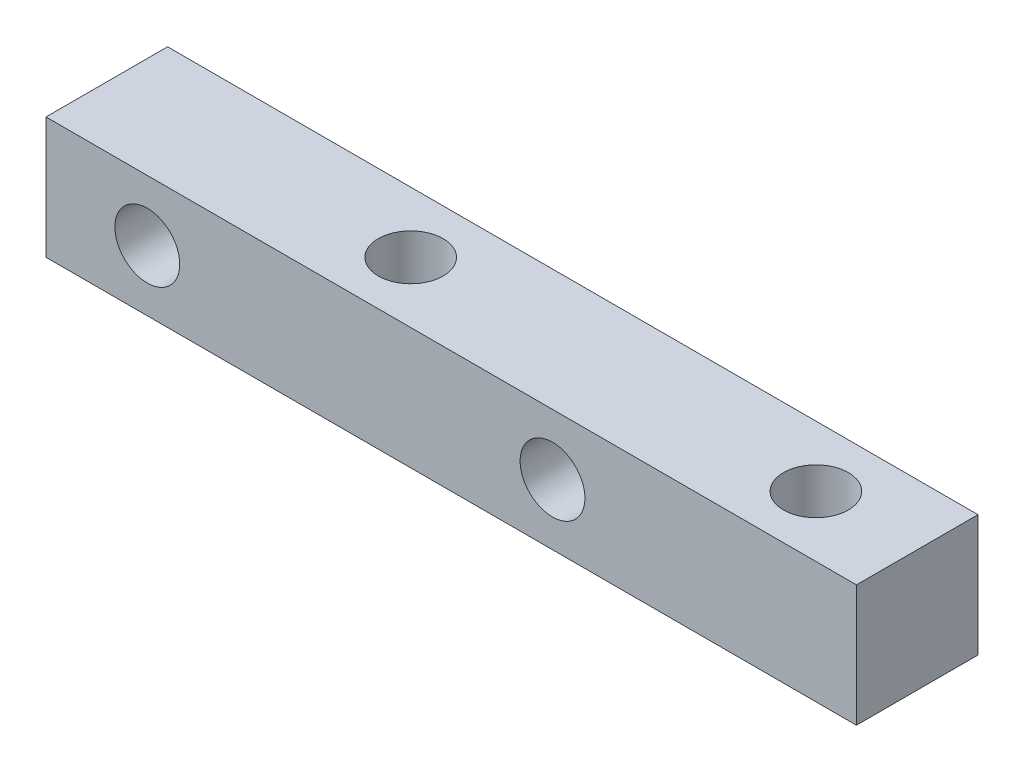
ISO-10303-21;
HEADER;
FILE_DESCRIPTION(('STEP AP214'),'2;1');
FILE_NAME('part.step','',(''),(''),'','','');
FILE_SCHEMA(('AUTOMOTIVE_DESIGN { 1 0 10303 214 1 1 1 1 }'));
ENDSEC;
DATA;
#1=APPLICATION_CONTEXT('core data for automotive mechanical design processes');
#2=APPLICATION_PROTOCOL_DEFINITION('international standard','automotive_design',2000,#1);
#3=PRODUCT_CONTEXT('',#1,'mechanical');
#4=PRODUCT('Part','Part','',(#3));
#5=PRODUCT_RELATED_PRODUCT_CATEGORY('part','',(#4));
#6=PRODUCT_DEFINITION_FORMATION('','',#4);
#7=PRODUCT_DEFINITION_CONTEXT('part definition',#1,'design');
#8=PRODUCT_DEFINITION('design','',#6,#7);
#9=PRODUCT_DEFINITION_SHAPE('','',#8);
#10=(LENGTH_UNIT() NAMED_UNIT(*) SI_UNIT(.MILLI.,.METRE.));
#11=(NAMED_UNIT(*) PLANE_ANGLE_UNIT() SI_UNIT($,.RADIAN.));
#12=(NAMED_UNIT(*) SI_UNIT($,.STERADIAN.) SOLID_ANGLE_UNIT());
#13=UNCERTAINTY_MEASURE_WITH_UNIT(LENGTH_MEASURE(1.E-05),#10,'distance_accuracy_value','');
#14=(GEOMETRIC_REPRESENTATION_CONTEXT(3) GLOBAL_UNCERTAINTY_ASSIGNED_CONTEXT((#13)) GLOBAL_UNIT_ASSIGNED_CONTEXT((#10,
#11,#12)) REPRESENTATION_CONTEXT('',''));
#15=CARTESIAN_POINT('',(0.,0.,0.));
#16=DIRECTION('',(0.,0.,1.));
#17=DIRECTION('',(1.,0.,0.));
#18=AXIS2_PLACEMENT_3D('',#15,#16,#17);
#19=CARTESIAN_POINT('',(0.,0.,6.));
#20=DIRECTION('',(0.,0.,-1.));
#21=DIRECTION('',(-1.,0.,0.));
#22=AXIS2_PLACEMENT_3D('',#19,#20,#21);
#23=PLANE('',#22);
#24=DIRECTION('',(1.,0.,0.));
#25=VECTOR('',#24,1.);
#26=CARTESIAN_POINT('',(40.,0.,6.));
#27=LINE('',#26,#25);
#28=CARTESIAN_POINT('',(0.,0.,6.));
#29=VERTEX_POINT('',#28);
#30=CARTESIAN_POINT('',(40.,0.,6.));
#31=VERTEX_POINT('',#30);
#32=EDGE_CURVE('E92',#29,#31,#27,.T.);
#33=ORIENTED_EDGE('',*,*,#32,.T.);
#34=DIRECTION('',(0.,1.,0.));
#35=VECTOR('',#34,1.);
#36=CARTESIAN_POINT('',(40.,6.,6.));
#37=LINE('',#36,#35);
#38=CARTESIAN_POINT('',(40.,6.,6.));
#39=VERTEX_POINT('',#38);
#40=EDGE_CURVE('E87',#31,#39,#37,.T.);
#41=ORIENTED_EDGE('',*,*,#40,.T.);
#42=DIRECTION('',(-1.,0.,0.));
#43=VECTOR('',#42,1.);
#44=CARTESIAN_POINT('',(0.,6.,6.));
#45=LINE('',#44,#43);
#46=CARTESIAN_POINT('',(0.,6.,6.));
#47=VERTEX_POINT('',#46);
#48=EDGE_CURVE('E90',#39,#47,#45,.T.);
#49=ORIENTED_EDGE('',*,*,#48,.T.);
#50=DIRECTION('',(0.,-1.,0.));
#51=VECTOR('',#50,1.);
#52=CARTESIAN_POINT('',(0.,0.,6.));
#53=LINE('',#52,#51);
#54=EDGE_CURVE('E57',#47,#29,#53,.T.);
#55=ORIENTED_EDGE('',*,*,#54,.T.);
#56=EDGE_LOOP('',(#33,#41,#49,#55));
#57=FACE_BOUND('',#56,.T.);
#58=CARTESIAN_POINT('',(5.,3.,6.));
#59=DIRECTION('',(0.,0.,1.));
#60=DIRECTION('',(1.,0.,0.));
#61=AXIS2_PLACEMENT_3D('',#58,#59,#60);
#62=CIRCLE('',#61,1.6);
#63=CARTESIAN_POINT('',(6.6,3.,6.));
#64=VERTEX_POINT('',#63);
#65=EDGE_CURVE('E112',#64,#64,#62,.T.);
#66=ORIENTED_EDGE('',*,*,#65,.F.);
#67=EDGE_LOOP('',(#66));
#68=FACE_BOUND('',#67,.T.);
#69=CARTESIAN_POINT('',(25.,3.,6.));
#70=DIRECTION('',(0.,0.,1.));
#71=DIRECTION('',(1.,0.,0.));
#72=AXIS2_PLACEMENT_3D('',#69,#70,#71);
#73=CIRCLE('',#72,1.6);
#74=CARTESIAN_POINT('',(26.6,3.,6.));
#75=VERTEX_POINT('',#74);
#76=EDGE_CURVE('E134',#75,#75,#73,.T.);
#77=ORIENTED_EDGE('',*,*,#76,.F.);
#78=EDGE_LOOP('',(#77));
#79=FACE_BOUND('',#78,.T.);
#80=ADVANCED_FACE('F39',(#57,#68,#79),#23,.F.);
#81=CARTESIAN_POINT('',(0.,0.,0.));
#82=DIRECTION('',(0.,0.,-1.));
#83=DIRECTION('',(-1.,0.,0.));
#84=AXIS2_PLACEMENT_3D('',#81,#82,#83);
#85=PLANE('',#84);
#86=CARTESIAN_POINT('',(5.,3.,0.));
#87=DIRECTION('',(0.,0.,1.));
#88=DIRECTION('',(1.,0.,0.));
#89=AXIS2_PLACEMENT_3D('',#86,#87,#88);
#90=CIRCLE('',#89,1.6);
#91=CARTESIAN_POINT('',(6.6,3.,0.));
#92=VERTEX_POINT('',#91);
#93=EDGE_CURVE('E130',#92,#92,#90,.T.);
#94=ORIENTED_EDGE('',*,*,#93,.T.);
#95=EDGE_LOOP('',(#94));
#96=FACE_BOUND('',#95,.T.);
#97=DIRECTION('',(1.,0.,0.));
#98=VECTOR('',#97,1.);
#99=CARTESIAN_POINT('',(40.,0.,0.));
#100=LINE('',#99,#98);
#101=CARTESIAN_POINT('',(0.,0.,0.));
#102=VERTEX_POINT('',#101);
#103=CARTESIAN_POINT('',(40.,0.,0.));
#104=VERTEX_POINT('',#103);
#105=EDGE_CURVE('E108',#102,#104,#100,.T.);
#106=ORIENTED_EDGE('',*,*,#105,.F.);
#107=DIRECTION('',(0.,-1.,0.));
#108=VECTOR('',#107,1.);
#109=CARTESIAN_POINT('',(0.,0.,0.));
#110=LINE('',#109,#108);
#111=CARTESIAN_POINT('',(0.,6.,0.));
#112=VERTEX_POINT('',#111);
#113=EDGE_CURVE('E80',#112,#102,#110,.T.);
#114=ORIENTED_EDGE('',*,*,#113,.F.);
#115=DIRECTION('',(-1.,0.,0.));
#116=VECTOR('',#115,1.);
#117=CARTESIAN_POINT('',(0.,6.,0.));
#118=LINE('',#117,#116);
#119=CARTESIAN_POINT('',(40.,6.,0.));
#120=VERTEX_POINT('',#119);
#121=EDGE_CURVE('E74',#120,#112,#118,.T.);
#122=ORIENTED_EDGE('',*,*,#121,.F.);
#123=DIRECTION('',(0.,1.,0.));
#124=VECTOR('',#123,1.);
#125=CARTESIAN_POINT('',(40.,6.,0.));
#126=LINE('',#125,#124);
#127=EDGE_CURVE('E97',#104,#120,#126,.T.);
#128=ORIENTED_EDGE('',*,*,#127,.F.);
#129=EDGE_LOOP('',(#106,#114,#122,#128));
#130=FACE_BOUND('',#129,.T.);
#131=CARTESIAN_POINT('',(25.,3.,0.));
#132=DIRECTION('',(0.,0.,1.));
#133=DIRECTION('',(1.,0.,0.));
#134=AXIS2_PLACEMENT_3D('',#131,#132,#133);
#135=CIRCLE('',#134,1.6);
#136=CARTESIAN_POINT('',(26.6,3.,0.));
#137=VERTEX_POINT('',#136);
#138=EDGE_CURVE('E138',#137,#137,#135,.T.);
#139=ORIENTED_EDGE('',*,*,#138,.T.);
#140=EDGE_LOOP('',(#139));
#141=FACE_BOUND('',#140,.T.);
#142=ADVANCED_FACE('F125',(#96,#130,#141),#85,.T.);
#143=CARTESIAN_POINT('',(40.,0.,6.));
#144=DIRECTION('',(0.,1.,0.));
#145=DIRECTION('',(0.,0.,1.));
#146=AXIS2_PLACEMENT_3D('',#143,#144,#145);
#147=PLANE('',#146);
#148=CARTESIAN_POINT('',(15.,0.,3.));
#149=DIRECTION('',(0.,1.,0.));
#150=DIRECTION('',(0.,0.,1.));
#151=AXIS2_PLACEMENT_3D('',#148,#149,#150);
#152=CIRCLE('',#151,1.6);
#153=CARTESIAN_POINT('',(15.,0.,4.6));
#154=VERTEX_POINT('',#153);
#155=EDGE_CURVE('E142',#154,#154,#152,.T.);
#156=ORIENTED_EDGE('',*,*,#155,.T.);
#157=EDGE_LOOP('',(#156));
#158=FACE_BOUND('',#157,.T.);
#159=CARTESIAN_POINT('',(35.,0.,3.));
#160=DIRECTION('',(0.,1.,0.));
#161=DIRECTION('',(0.,0.,1.));
#162=AXIS2_PLACEMENT_3D('',#159,#160,#161);
#163=CIRCLE('',#162,1.6);
#164=CARTESIAN_POINT('',(35.,0.,4.6));
#165=VERTEX_POINT('',#164);
#166=EDGE_CURVE('E150',#165,#165,#163,.T.);
#167=ORIENTED_EDGE('',*,*,#166,.T.);
#168=EDGE_LOOP('',(#167));
#169=FACE_BOUND('',#168,.T.);
#170=ORIENTED_EDGE('',*,*,#105,.T.);
#171=DIRECTION('',(0.,0.,-1.));
#172=VECTOR('',#171,1.);
#173=CARTESIAN_POINT('',(40.,0.,6.));
#174=LINE('',#173,#172);
#175=EDGE_CURVE('E11',#31,#104,#174,.T.);
#176=ORIENTED_EDGE('',*,*,#175,.F.);
#177=ORIENTED_EDGE('',*,*,#32,.F.);
#178=DIRECTION('',(0.,0.,-1.));
#179=VECTOR('',#178,1.);
#180=CARTESIAN_POINT('',(0.,0.,6.));
#181=LINE('',#180,#179);
#182=EDGE_CURVE('E104',#29,#102,#181,.T.);
#183=ORIENTED_EDGE('',*,*,#182,.T.);
#184=EDGE_LOOP('',(#170,#176,#177,#183));
#185=FACE_BOUND('',#184,.T.);
#186=ADVANCED_FACE('F41',(#158,#169,#185),#147,.F.);
#187=CARTESIAN_POINT('',(40.,6.,6.));
#188=DIRECTION('',(-1.,0.,0.));
#189=DIRECTION('',(0.,0.,1.));
#190=AXIS2_PLACEMENT_3D('',#187,#188,#189);
#191=PLANE('',#190);
#192=ORIENTED_EDGE('',*,*,#127,.T.);
#193=DIRECTION('',(0.,0.,-1.));
#194=VECTOR('',#193,1.);
#195=CARTESIAN_POINT('',(40.,6.,6.));
#196=LINE('',#195,#194);
#197=EDGE_CURVE('E49',#39,#120,#196,.T.);
#198=ORIENTED_EDGE('',*,*,#197,.F.);
#199=ORIENTED_EDGE('',*,*,#40,.F.);
#200=ORIENTED_EDGE('',*,*,#175,.T.);
#201=EDGE_LOOP('',(#192,#198,#199,#200));
#202=FACE_BOUND('',#201,.T.);
#203=ADVANCED_FACE('F96',(#202),#191,.F.);
#204=CARTESIAN_POINT('',(0.,6.,6.));
#205=DIRECTION('',(0.,-1.,0.));
#206=DIRECTION('',(0.,0.,-1.));
#207=AXIS2_PLACEMENT_3D('',#204,#205,#206);
#208=PLANE('',#207);
#209=CARTESIAN_POINT('',(15.,6.,3.));
#210=DIRECTION('',(0.,1.,0.));
#211=DIRECTION('',(0.,0.,1.));
#212=AXIS2_PLACEMENT_3D('',#209,#210,#211);
#213=CIRCLE('',#212,1.6);
#214=CARTESIAN_POINT('',(15.,6.,4.6));
#215=VERTEX_POINT('',#214);
#216=EDGE_CURVE('E154',#215,#215,#213,.T.);
#217=ORIENTED_EDGE('',*,*,#216,.F.);
#218=EDGE_LOOP('',(#217));
#219=FACE_BOUND('',#218,.T.);
#220=CARTESIAN_POINT('',(35.,6.,3.));
#221=DIRECTION('',(0.,1.,0.));
#222=DIRECTION('',(0.,0.,1.));
#223=AXIS2_PLACEMENT_3D('',#220,#221,#222);
#224=CIRCLE('',#223,1.6);
#225=CARTESIAN_POINT('',(35.,6.,4.6));
#226=VERTEX_POINT('',#225);
#227=EDGE_CURVE('E146',#226,#226,#224,.T.);
#228=ORIENTED_EDGE('',*,*,#227,.F.);
#229=EDGE_LOOP('',(#228));
#230=FACE_BOUND('',#229,.T.);
#231=ORIENTED_EDGE('',*,*,#121,.T.);
#232=DIRECTION('',(0.,0.,-1.));
#233=VECTOR('',#232,1.);
#234=CARTESIAN_POINT('',(0.,6.,6.));
#235=LINE('',#234,#233);
#236=EDGE_CURVE('E99',#47,#112,#235,.T.);
#237=ORIENTED_EDGE('',*,*,#236,.F.);
#238=ORIENTED_EDGE('',*,*,#48,.F.);
#239=ORIENTED_EDGE('',*,*,#197,.T.);
#240=EDGE_LOOP('',(#231,#237,#238,#239));
#241=FACE_BOUND('',#240,.T.);
#242=ADVANCED_FACE('F100',(#219,#230,#241),#208,.F.);
#243=CARTESIAN_POINT('',(0.,0.,6.));
#244=DIRECTION('',(1.,0.,0.));
#245=DIRECTION('',(0.,0.,-1.));
#246=AXIS2_PLACEMENT_3D('',#243,#244,#245);
#247=PLANE('',#246);
#248=ORIENTED_EDGE('',*,*,#113,.T.);
#249=ORIENTED_EDGE('',*,*,#182,.F.);
#250=ORIENTED_EDGE('',*,*,#54,.F.);
#251=ORIENTED_EDGE('',*,*,#236,.T.);
#252=EDGE_LOOP('',(#248,#249,#250,#251));
#253=FACE_BOUND('',#252,.T.);
#254=ADVANCED_FACE('F122',(#253),#247,.F.);
#255=CARTESIAN_POINT('',(5.,3.,6.));
#256=DIRECTION('',(0.,0.,-1.));
#257=DIRECTION('',(-1.,0.,0.));
#258=AXIS2_PLACEMENT_3D('',#255,#256,#257);
#259=CYLINDRICAL_SURFACE('',#258,1.6);
#260=ORIENTED_EDGE('',*,*,#65,.T.);
#261=EDGE_LOOP('',(#260));
#262=FACE_BOUND('',#261,.T.);
#263=ORIENTED_EDGE('',*,*,#93,.F.);
#264=EDGE_LOOP('',(#263));
#265=FACE_BOUND('',#264,.T.);
#266=ADVANCED_FACE('F183',(#262,#265),#259,.F.);
#267=CARTESIAN_POINT('',(25.,3.,6.));
#268=DIRECTION('',(0.,0.,-1.));
#269=DIRECTION('',(-1.,0.,0.));
#270=AXIS2_PLACEMENT_3D('',#267,#268,#269);
#271=CYLINDRICAL_SURFACE('',#270,1.6);
#272=ORIENTED_EDGE('',*,*,#76,.T.);
#273=EDGE_LOOP('',(#272));
#274=FACE_BOUND('',#273,.T.);
#275=ORIENTED_EDGE('',*,*,#138,.F.);
#276=EDGE_LOOP('',(#275));
#277=FACE_BOUND('',#276,.T.);
#278=ADVANCED_FACE('F177',(#274,#277),#271,.F.);
#279=CARTESIAN_POINT('',(35.,0.,3.));
#280=DIRECTION('',(0.,1.,0.));
#281=DIRECTION('',(0.,0.,1.));
#282=AXIS2_PLACEMENT_3D('',#279,#280,#281);
#283=CYLINDRICAL_SURFACE('',#282,1.6);
#284=ORIENTED_EDGE('',*,*,#166,.F.);
#285=EDGE_LOOP('',(#284));
#286=FACE_BOUND('',#285,.T.);
#287=ORIENTED_EDGE('',*,*,#227,.T.);
#288=EDGE_LOOP('',(#287));
#289=FACE_BOUND('',#288,.T.);
#290=ADVANCED_FACE('F167',(#286,#289),#283,.F.);
#291=CARTESIAN_POINT('',(15.,0.,3.));
#292=DIRECTION('',(0.,1.,0.));
#293=DIRECTION('',(0.,0.,1.));
#294=AXIS2_PLACEMENT_3D('',#291,#292,#293);
#295=CYLINDRICAL_SURFACE('',#294,1.6);
#296=ORIENTED_EDGE('',*,*,#155,.F.);
#297=EDGE_LOOP('',(#296));
#298=FACE_BOUND('',#297,.T.);
#299=ORIENTED_EDGE('',*,*,#216,.T.);
#300=EDGE_LOOP('',(#299));
#301=FACE_BOUND('',#300,.T.);
#302=ADVANCED_FACE('F164',(#298,#301),#295,.F.);
#303=CLOSED_SHELL('',(#80,#142,#186,#203,#242,#254,#266,#278,#290,#302));
#304=MANIFOLD_SOLID_BREP('B2',#303);
#305=ADVANCED_BREP_SHAPE_REPRESENTATION('',(#18,#304),#14);
#306=SHAPE_DEFINITION_REPRESENTATION(#9,#305);
ENDSEC;
END-ISO-10303-21;
